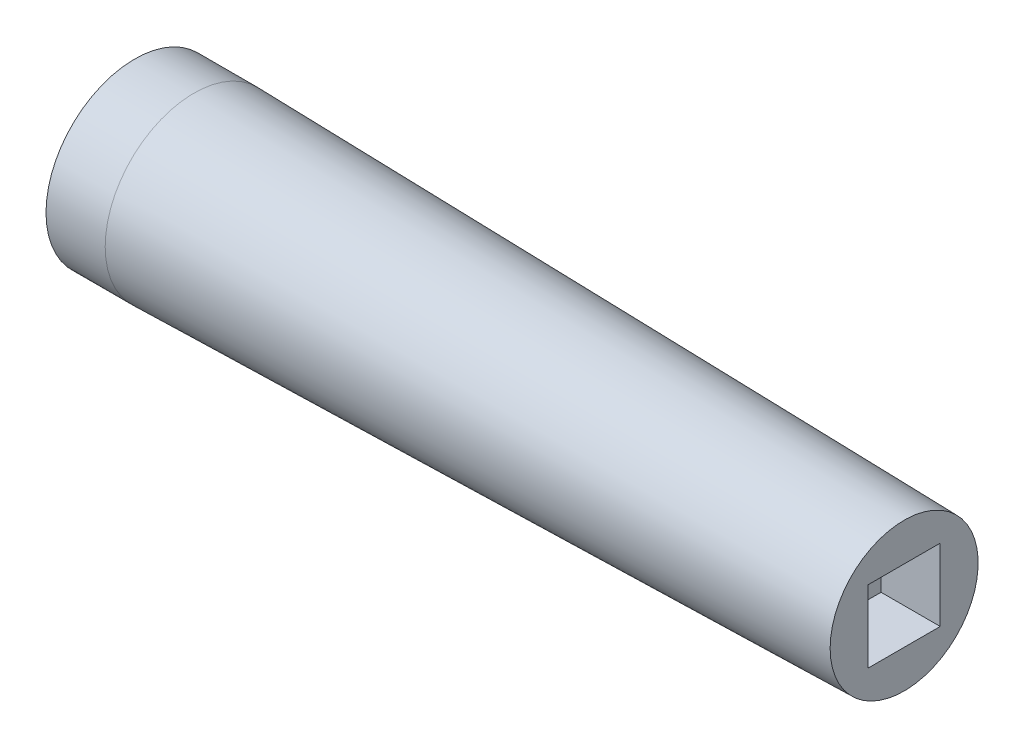
ISO-10303-21;
HEADER;
FILE_DESCRIPTION(('STEP AP214'),'2;1');
FILE_NAME('part.step','',(''),(''),'','','');
FILE_SCHEMA(('AUTOMOTIVE_DESIGN { 1 0 10303 214 1 1 1 1 }'));
ENDSEC;
DATA;
#1=APPLICATION_CONTEXT('core data for automotive mechanical design processes');
#2=APPLICATION_PROTOCOL_DEFINITION('international standard','automotive_design',2000,#1);
#3=PRODUCT_CONTEXT('',#1,'mechanical');
#4=PRODUCT('Part','Part','',(#3));
#5=PRODUCT_RELATED_PRODUCT_CATEGORY('part','',(#4));
#6=PRODUCT_DEFINITION_FORMATION('','',#4);
#7=PRODUCT_DEFINITION_CONTEXT('part definition',#1,'design');
#8=PRODUCT_DEFINITION('design','',#6,#7);
#9=PRODUCT_DEFINITION_SHAPE('','',#8);
#10=(LENGTH_UNIT() NAMED_UNIT(*) SI_UNIT(.MILLI.,.METRE.));
#11=(NAMED_UNIT(*) PLANE_ANGLE_UNIT() SI_UNIT($,.RADIAN.));
#12=(NAMED_UNIT(*) SI_UNIT($,.STERADIAN.) SOLID_ANGLE_UNIT());
#13=UNCERTAINTY_MEASURE_WITH_UNIT(LENGTH_MEASURE(1.E-05),#10,'distance_accuracy_value','');
#14=(GEOMETRIC_REPRESENTATION_CONTEXT(3) GLOBAL_UNCERTAINTY_ASSIGNED_CONTEXT((#13)) GLOBAL_UNIT_ASSIGNED_CONTEXT((#10,
#11,#12)) REPRESENTATION_CONTEXT('',''));
#15=CARTESIAN_POINT('',(0.,0.,0.));
#16=DIRECTION('',(0.,0.,1.));
#17=DIRECTION('',(1.,0.,0.));
#18=AXIS2_PLACEMENT_3D('',#15,#16,#17);
#19=CARTESIAN_POINT('',(0.,0.,-19.05));
#20=DIRECTION('',(1.,0.,0.));
#21=DIRECTION('',(0.,0.,-1.));
#22=AXIS2_PLACEMENT_3D('',#19,#20,#21);
#23=PLANE('',#22);
#24=CARTESIAN_POINT('',(0.,0.,0.));
#25=DIRECTION('',(-1.,0.,0.));
#26=DIRECTION('',(0.,0.,1.));
#27=AXIS2_PLACEMENT_3D('',#24,#25,#26);
#28=CIRCLE('',#27,19.05);
#29=CARTESIAN_POINT('',(0.,0.,19.05));
#30=VERTEX_POINT('',#29);
#31=EDGE_CURVE('E135',#30,#30,#28,.T.);
#32=ORIENTED_EDGE('',*,*,#31,.T.);
#33=EDGE_LOOP('',(#32));
#34=FACE_BOUND('',#33,.T.);
#35=ADVANCED_FACE('F48',(#34),#23,.F.);
#36=CARTESIAN_POINT('',(165.1,0.,0.));
#37=DIRECTION('',(-1.,0.,0.));
#38=DIRECTION('',(0.,0.,1.));
#39=AXIS2_PLACEMENT_3D('',#36,#37,#38);
#40=PLANE('',#39);
#41=DIRECTION('',(0.,0.,1.));
#42=VECTOR('',#41,1.);
#43=CARTESIAN_POINT('',(165.1,7.745,7.745));
#44=LINE('',#43,#42);
#45=CARTESIAN_POINT('',(165.1,7.745,-7.745));
#46=VERTEX_POINT('',#45);
#47=CARTESIAN_POINT('',(165.1,7.745,7.745));
#48=VERTEX_POINT('',#47);
#49=EDGE_CURVE('E98',#46,#48,#44,.T.);
#50=ORIENTED_EDGE('',*,*,#49,.F.);
#51=DIRECTION('',(0.,1.,0.));
#52=VECTOR('',#51,1.);
#53=CARTESIAN_POINT('',(165.1,-7.745,-7.745));
#54=LINE('',#53,#52);
#55=CARTESIAN_POINT('',(165.1,-7.745,-7.745));
#56=VERTEX_POINT('',#55);
#57=EDGE_CURVE('E63',#56,#46,#54,.T.);
#58=ORIENTED_EDGE('',*,*,#57,.F.);
#59=DIRECTION('',(0.,0.,-1.));
#60=VECTOR('',#59,1.);
#61=CARTESIAN_POINT('',(165.1,-7.745,7.745));
#62=LINE('',#61,#60);
#63=CARTESIAN_POINT('',(165.1,-7.745,7.745));
#64=VERTEX_POINT('',#63);
#65=EDGE_CURVE('E119',#64,#56,#62,.T.);
#66=ORIENTED_EDGE('',*,*,#65,.F.);
#67=DIRECTION('',(0.,-1.,0.));
#68=VECTOR('',#67,1.);
#69=CARTESIAN_POINT('',(165.1,-7.745,7.745));
#70=LINE('',#69,#68);
#71=EDGE_CURVE('E128',#48,#64,#70,.T.);
#72=ORIENTED_EDGE('',*,*,#71,.F.);
#73=EDGE_LOOP('',(#50,#58,#66,#72));
#74=FACE_BOUND('',#73,.T.);
#75=CARTESIAN_POINT('',(165.1,0.,0.));
#76=DIRECTION('',(-1.,0.,0.));
#77=DIRECTION('',(0.,0.,1.));
#78=AXIS2_PLACEMENT_3D('',#75,#76,#77);
#79=CIRCLE('',#78,15.88);
#80=CARTESIAN_POINT('',(165.1,0.,15.88));
#81=VERTEX_POINT('',#80);
#82=EDGE_CURVE('E13',#81,#81,#79,.T.);
#83=ORIENTED_EDGE('',*,*,#82,.F.);
#84=EDGE_LOOP('',(#83));
#85=FACE_BOUND('',#84,.T.);
#86=ADVANCED_FACE('F152',(#74,#85),#40,.F.);
#87=CARTESIAN_POINT('',(165.1,0.,0.));
#88=DIRECTION('',(-1.,0.,0.));
#89=DIRECTION('',(0.,0.,1.));
#90=AXIS2_PLACEMENT_3D('',#87,#88,#89);
#91=CONICAL_SURFACE('',#90,15.88,0.020797525848452);
#92=CARTESIAN_POINT('',(12.7,0.,0.));
#93=DIRECTION('',(-1.,0.,0.));
#94=DIRECTION('',(0.,0.,1.));
#95=AXIS2_PLACEMENT_3D('',#92,#93,#94);
#96=CIRCLE('',#95,19.05);
#97=CARTESIAN_POINT('',(12.7,0.,19.05));
#98=VERTEX_POINT('',#97);
#99=EDGE_CURVE('E56',#98,#98,#96,.T.);
#100=ORIENTED_EDGE('',*,*,#99,.F.);
#101=EDGE_LOOP('',(#100));
#102=FACE_BOUND('',#101,.T.);
#103=ORIENTED_EDGE('',*,*,#82,.T.);
#104=EDGE_LOOP('',(#103));
#105=FACE_BOUND('',#104,.T.);
#106=ADVANCED_FACE('F149',(#102,#105),#91,.T.);
#107=CARTESIAN_POINT('',(0.,0.,0.));
#108=DIRECTION('',(-1.,0.,0.));
#109=DIRECTION('',(0.,0.,1.));
#110=AXIS2_PLACEMENT_3D('',#107,#108,#109);
#111=CYLINDRICAL_SURFACE('',#110,19.05);
#112=ORIENTED_EDGE('',*,*,#31,.F.);
#113=EDGE_LOOP('',(#112));
#114=FACE_BOUND('',#113,.T.);
#115=ORIENTED_EDGE('',*,*,#99,.T.);
#116=EDGE_LOOP('',(#115));
#117=FACE_BOUND('',#116,.T.);
#118=ADVANCED_FACE('F147',(#114,#117),#111,.T.);
#119=CARTESIAN_POINT('',(152.4,-7.745,-7.745));
#120=DIRECTION('',(0.,0.,-1.));
#121=DIRECTION('',(-1.,0.,0.));
#122=AXIS2_PLACEMENT_3D('',#119,#120,#121);
#123=PLANE('',#122);
#124=ORIENTED_EDGE('',*,*,#57,.T.);
#125=DIRECTION('',(1.,0.,0.));
#126=VECTOR('',#125,1.);
#127=CARTESIAN_POINT('',(152.4,7.745,-7.745));
#128=LINE('',#127,#126);
#129=CARTESIAN_POINT('',(152.4,7.745,-7.745));
#130=VERTEX_POINT('',#129);
#131=EDGE_CURVE('E86',#130,#46,#128,.T.);
#132=ORIENTED_EDGE('',*,*,#131,.F.);
#133=DIRECTION('',(0.,1.,0.));
#134=VECTOR('',#133,1.);
#135=CARTESIAN_POINT('',(152.4,-7.745,-7.745));
#136=LINE('',#135,#134);
#137=CARTESIAN_POINT('',(152.4,-7.745,-7.745));
#138=VERTEX_POINT('',#137);
#139=EDGE_CURVE('E114',#138,#130,#136,.T.);
#140=ORIENTED_EDGE('',*,*,#139,.F.);
#141=DIRECTION('',(1.,0.,0.));
#142=VECTOR('',#141,1.);
#143=CARTESIAN_POINT('',(152.4,-7.745,-7.745));
#144=LINE('',#143,#142);
#145=EDGE_CURVE('E71',#138,#56,#144,.T.);
#146=ORIENTED_EDGE('',*,*,#145,.T.);
#147=EDGE_LOOP('',(#124,#132,#140,#146));
#148=FACE_BOUND('',#147,.T.);
#149=ADVANCED_FACE('F165',(#148),#123,.F.);
#150=CARTESIAN_POINT('',(152.4,-7.745,7.745));
#151=DIRECTION('',(0.,-1.,0.));
#152=DIRECTION('',(0.,0.,-1.));
#153=AXIS2_PLACEMENT_3D('',#150,#151,#152);
#154=PLANE('',#153);
#155=ORIENTED_EDGE('',*,*,#65,.T.);
#156=ORIENTED_EDGE('',*,*,#145,.F.);
#157=DIRECTION('',(0.,0.,-1.));
#158=VECTOR('',#157,1.);
#159=CARTESIAN_POINT('',(152.4,-7.745,7.745));
#160=LINE('',#159,#158);
#161=CARTESIAN_POINT('',(152.4,-7.745,7.745));
#162=VERTEX_POINT('',#161);
#163=EDGE_CURVE('E111',#162,#138,#160,.T.);
#164=ORIENTED_EDGE('',*,*,#163,.F.);
#165=DIRECTION('',(1.,0.,0.));
#166=VECTOR('',#165,1.);
#167=CARTESIAN_POINT('',(152.4,-7.745,7.745));
#168=LINE('',#167,#166);
#169=EDGE_CURVE('E103',#162,#64,#168,.T.);
#170=ORIENTED_EDGE('',*,*,#169,.T.);
#171=EDGE_LOOP('',(#155,#156,#164,#170));
#172=FACE_BOUND('',#171,.T.);
#173=ADVANCED_FACE('F169',(#172),#154,.F.);
#174=CARTESIAN_POINT('',(152.4,-7.745,7.745));
#175=DIRECTION('',(0.,0.,1.));
#176=DIRECTION('',(1.,0.,0.));
#177=AXIS2_PLACEMENT_3D('',#174,#175,#176);
#178=PLANE('',#177);
#179=ORIENTED_EDGE('',*,*,#71,.T.);
#180=ORIENTED_EDGE('',*,*,#169,.F.);
#181=DIRECTION('',(0.,-1.,0.));
#182=VECTOR('',#181,1.);
#183=CARTESIAN_POINT('',(152.4,-7.745,7.745));
#184=LINE('',#183,#182);
#185=CARTESIAN_POINT('',(152.4,7.745,7.745));
#186=VERTEX_POINT('',#185);
#187=EDGE_CURVE('E106',#186,#162,#184,.T.);
#188=ORIENTED_EDGE('',*,*,#187,.F.);
#189=DIRECTION('',(1.,0.,0.));
#190=VECTOR('',#189,1.);
#191=CARTESIAN_POINT('',(152.4,7.745,7.745));
#192=LINE('',#191,#190);
#193=EDGE_CURVE('E91',#186,#48,#192,.T.);
#194=ORIENTED_EDGE('',*,*,#193,.T.);
#195=EDGE_LOOP('',(#179,#180,#188,#194));
#196=FACE_BOUND('',#195,.T.);
#197=ADVANCED_FACE('F107',(#196),#178,.F.);
#198=CARTESIAN_POINT('',(152.4,7.745,7.745));
#199=DIRECTION('',(0.,1.,0.));
#200=DIRECTION('',(0.,0.,1.));
#201=AXIS2_PLACEMENT_3D('',#198,#199,#200);
#202=PLANE('',#201);
#203=ORIENTED_EDGE('',*,*,#49,.T.);
#204=ORIENTED_EDGE('',*,*,#193,.F.);
#205=DIRECTION('',(0.,0.,1.));
#206=VECTOR('',#205,1.);
#207=CARTESIAN_POINT('',(152.4,7.745,7.745));
#208=LINE('',#207,#206);
#209=EDGE_CURVE('E95',#130,#186,#208,.T.);
#210=ORIENTED_EDGE('',*,*,#209,.F.);
#211=ORIENTED_EDGE('',*,*,#131,.T.);
#212=EDGE_LOOP('',(#203,#204,#210,#211));
#213=FACE_BOUND('',#212,.T.);
#214=ADVANCED_FACE('F93',(#213),#202,.F.);
#215=CARTESIAN_POINT('',(152.4,0.,0.));
#216=DIRECTION('',(-1.,0.,0.));
#217=DIRECTION('',(0.,0.,1.));
#218=AXIS2_PLACEMENT_3D('',#215,#216,#217);
#219=PLANE('',#218);
#220=ORIENTED_EDGE('',*,*,#139,.T.);
#221=ORIENTED_EDGE('',*,*,#209,.T.);
#222=ORIENTED_EDGE('',*,*,#187,.T.);
#223=ORIENTED_EDGE('',*,*,#163,.T.);
#224=EDGE_LOOP('',(#220,#221,#222,#223));
#225=FACE_BOUND('',#224,.T.);
#226=ADVANCED_FACE('F113',(#225),#219,.F.);
#227=CLOSED_SHELL('',(#35,#86,#106,#118,#149,#173,#197,#214,#226));
#228=MANIFOLD_SOLID_BREP('B2',#227);
#229=ADVANCED_BREP_SHAPE_REPRESENTATION('',(#18,#228),#14);
#230=SHAPE_DEFINITION_REPRESENTATION(#9,#229);
ENDSEC;
END-ISO-10303-21;
